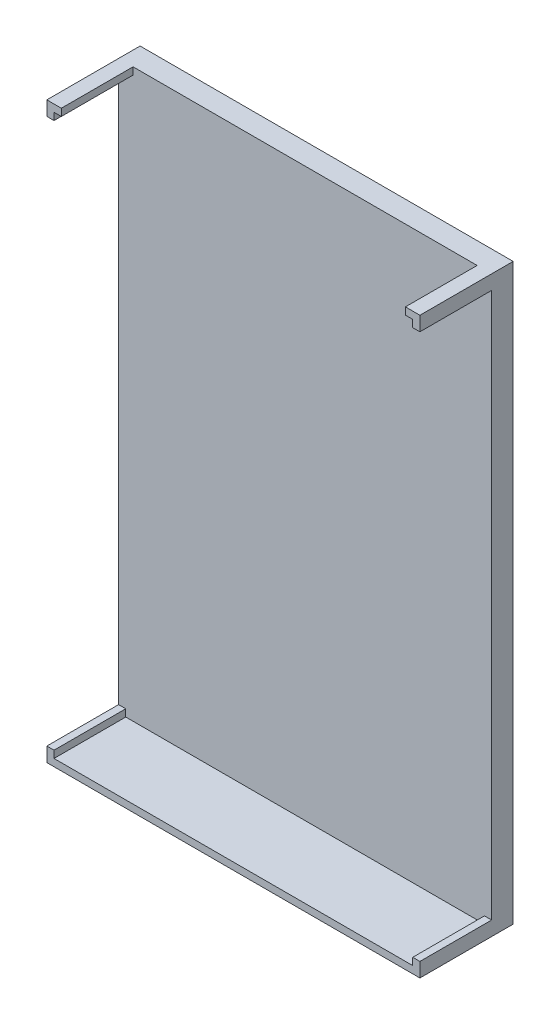
ISO-10303-21;
HEADER;
FILE_DESCRIPTION(('STEP AP214'),'2;1');
FILE_NAME('part.step','',(''),(''),'','','');
FILE_SCHEMA(('AUTOMOTIVE_DESIGN { 1 0 10303 214 1 1 1 1 }'));
ENDSEC;
DATA;
#1=APPLICATION_CONTEXT('core data for automotive mechanical design processes');
#2=APPLICATION_PROTOCOL_DEFINITION('international standard','automotive_design',2000,#1);
#3=PRODUCT_CONTEXT('',#1,'mechanical');
#4=PRODUCT('Part','Part','',(#3));
#5=PRODUCT_RELATED_PRODUCT_CATEGORY('part','',(#4));
#6=PRODUCT_DEFINITION_FORMATION('','',#4);
#7=PRODUCT_DEFINITION_CONTEXT('part definition',#1,'design');
#8=PRODUCT_DEFINITION('design','',#6,#7);
#9=PRODUCT_DEFINITION_SHAPE('','',#8);
#10=(LENGTH_UNIT() NAMED_UNIT(*) SI_UNIT(.MILLI.,.METRE.));
#11=(NAMED_UNIT(*) PLANE_ANGLE_UNIT() SI_UNIT($,.RADIAN.));
#12=(NAMED_UNIT(*) SI_UNIT($,.STERADIAN.) SOLID_ANGLE_UNIT());
#13=UNCERTAINTY_MEASURE_WITH_UNIT(LENGTH_MEASURE(1.E-05),#10,'distance_accuracy_value','');
#14=(GEOMETRIC_REPRESENTATION_CONTEXT(3) GLOBAL_UNCERTAINTY_ASSIGNED_CONTEXT((#13)) GLOBAL_UNIT_ASSIGNED_CONTEXT((#10,
#11,#12)) REPRESENTATION_CONTEXT('',''));
#15=CARTESIAN_POINT('',(0.,0.,0.));
#16=DIRECTION('',(0.,0.,1.));
#17=DIRECTION('',(1.,0.,0.));
#18=AXIS2_PLACEMENT_3D('',#15,#16,#17);
#19=CARTESIAN_POINT('',(0.,0.,0.));
#20=DIRECTION('',(0.,0.,1.));
#21=DIRECTION('',(1.,0.,0.));
#22=AXIS2_PLACEMENT_3D('',#19,#20,#21);
#23=PLANE('',#22);
#24=DIRECTION('',(1.,0.,0.));
#25=VECTOR('',#24,1.);
#26=CARTESIAN_POINT('',(0.,-39.,0.));
#27=LINE('',#26,#25);
#28=CARTESIAN_POINT('',(-25.,-39.,0.));
#29=VERTEX_POINT('',#28);
#30=CARTESIAN_POINT('',(25.,-39.,0.));
#31=VERTEX_POINT('',#30);
#32=EDGE_CURVE('E240',#29,#31,#27,.T.);
#33=ORIENTED_EDGE('',*,*,#32,.T.);
#34=DIRECTION('',(0.,-1.,0.));
#35=VECTOR('',#34,1.);
#36=CARTESIAN_POINT('',(25.,0.,0.));
#37=LINE('',#36,#35);
#38=CARTESIAN_POINT('',(25.,-38.,0.));
#39=VERTEX_POINT('',#38);
#40=EDGE_CURVE('E214',#39,#31,#37,.T.);
#41=ORIENTED_EDGE('',*,*,#40,.F.);
#42=DIRECTION('',(-1.,0.,0.));
#43=VECTOR('',#42,1.);
#44=CARTESIAN_POINT('',(0.,-38.,0.));
#45=LINE('',#44,#43);
#46=CARTESIAN_POINT('',(26.,-38.,0.));
#47=VERTEX_POINT('',#46);
#48=EDGE_CURVE('E217',#47,#39,#45,.T.);
#49=ORIENTED_EDGE('',*,*,#48,.F.);
#50=DIRECTION('',(0.,1.,0.));
#51=VECTOR('',#50,1.);
#52=CARTESIAN_POINT('',(26.,-40.,0.));
#53=LINE('',#52,#51);
#54=CARTESIAN_POINT('',(26.,38.,0.));
#55=VERTEX_POINT('',#54);
#56=EDGE_CURVE('E297',#47,#55,#53,.T.);
#57=ORIENTED_EDGE('',*,*,#56,.T.);
#58=DIRECTION('',(-1.,0.,0.));
#59=VECTOR('',#58,1.);
#60=CARTESIAN_POINT('',(0.,38.,0.));
#61=LINE('',#60,#59);
#62=CARTESIAN_POINT('',(25.,38.,0.));
#63=VERTEX_POINT('',#62);
#64=EDGE_CURVE('E242',#55,#63,#61,.T.);
#65=ORIENTED_EDGE('',*,*,#64,.T.);
#66=DIRECTION('',(0.,1.,0.));
#67=VECTOR('',#66,1.);
#68=CARTESIAN_POINT('',(25.,0.,0.));
#69=LINE('',#68,#67);
#70=CARTESIAN_POINT('',(25.,39.,0.));
#71=VERTEX_POINT('',#70);
#72=EDGE_CURVE('E258',#63,#71,#69,.T.);
#73=ORIENTED_EDGE('',*,*,#72,.T.);
#74=DIRECTION('',(-1.,0.,0.));
#75=VECTOR('',#74,1.);
#76=CARTESIAN_POINT('',(0.,39.,0.));
#77=LINE('',#76,#75);
#78=CARTESIAN_POINT('',(23.9789278514893,39.,0.));
#79=VERTEX_POINT('',#78);
#80=EDGE_CURVE('E278',#71,#79,#77,.T.);
#81=ORIENTED_EDGE('',*,*,#80,.T.);
#82=DIRECTION('',(0.,1.,0.));
#83=VECTOR('',#82,1.);
#84=CARTESIAN_POINT('',(23.9789278514893,0.,0.));
#85=LINE('',#84,#83);
#86=CARTESIAN_POINT('',(23.9789278514893,40.,0.));
#87=VERTEX_POINT('',#86);
#88=EDGE_CURVE('E275',#79,#87,#85,.T.);
#89=ORIENTED_EDGE('',*,*,#88,.T.);
#90=DIRECTION('',(-1.,0.,0.));
#91=VECTOR('',#90,1.);
#92=CARTESIAN_POINT('',(26.,40.,0.));
#93=LINE('',#92,#91);
#94=CARTESIAN_POINT('',(-23.9789278514893,40.,0.));
#95=VERTEX_POINT('',#94);
#96=EDGE_CURVE('E307',#87,#95,#93,.T.);
#97=ORIENTED_EDGE('',*,*,#96,.T.);
#98=DIRECTION('',(0.,1.,0.));
#99=VECTOR('',#98,1.);
#100=CARTESIAN_POINT('',(-23.9789278514893,39.,0.));
#101=LINE('',#100,#99);
#102=CARTESIAN_POINT('',(-23.9789278514893,39.,0.));
#103=VERTEX_POINT('',#102);
#104=EDGE_CURVE('E188',#103,#95,#101,.T.);
#105=ORIENTED_EDGE('',*,*,#104,.F.);
#106=DIRECTION('',(1.,0.,0.));
#107=VECTOR('',#106,1.);
#108=CARTESIAN_POINT('',(-25.,39.,0.));
#109=LINE('',#108,#107);
#110=CARTESIAN_POINT('',(-25.,39.,0.));
#111=VERTEX_POINT('',#110);
#112=EDGE_CURVE('E59',#111,#103,#109,.T.);
#113=ORIENTED_EDGE('',*,*,#112,.F.);
#114=DIRECTION('',(0.,1.,0.));
#115=VECTOR('',#114,1.);
#116=CARTESIAN_POINT('',(-25.,38.,0.));
#117=LINE('',#116,#115);
#118=CARTESIAN_POINT('',(-25.,38.,0.));
#119=VERTEX_POINT('',#118);
#120=EDGE_CURVE('E54',#119,#111,#117,.T.);
#121=ORIENTED_EDGE('',*,*,#120,.F.);
#122=DIRECTION('',(1.,0.,0.));
#123=VECTOR('',#122,1.);
#124=CARTESIAN_POINT('',(-26.,38.,0.));
#125=LINE('',#124,#123);
#126=CARTESIAN_POINT('',(-26.,38.,0.));
#127=VERTEX_POINT('',#126);
#128=EDGE_CURVE('E207',#127,#119,#125,.T.);
#129=ORIENTED_EDGE('',*,*,#128,.F.);
#130=DIRECTION('',(0.,1.,0.));
#131=VECTOR('',#130,1.);
#132=CARTESIAN_POINT('',(-26.,-40.,0.));
#133=LINE('',#132,#131);
#134=CARTESIAN_POINT('',(-26.,-38.,0.));
#135=VERTEX_POINT('',#134);
#136=EDGE_CURVE('E293',#135,#127,#133,.T.);
#137=ORIENTED_EDGE('',*,*,#136,.F.);
#138=DIRECTION('',(1.,0.,0.));
#139=VECTOR('',#138,1.);
#140=CARTESIAN_POINT('',(0.,-38.,0.));
#141=LINE('',#140,#139);
#142=CARTESIAN_POINT('',(-25.,-38.,0.));
#143=VERTEX_POINT('',#142);
#144=EDGE_CURVE('E233',#135,#143,#141,.T.);
#145=ORIENTED_EDGE('',*,*,#144,.T.);
#146=DIRECTION('',(0.,-1.,0.));
#147=VECTOR('',#146,1.);
#148=CARTESIAN_POINT('',(-25.,0.,0.));
#149=LINE('',#148,#147);
#150=EDGE_CURVE('E236',#143,#29,#149,.T.);
#151=ORIENTED_EDGE('',*,*,#150,.T.);
#152=EDGE_LOOP('',(#33,#41,#49,#57,#65,#73,#81,#89,#97,#105,#113,#121,#129,#137,#145,#151));
#153=FACE_BOUND('',#152,.T.);
#154=ADVANCED_FACE('F39',(#153),#23,.T.);
#155=CARTESIAN_POINT('',(-26.,-40.,-3.));
#156=DIRECTION('',(1.,0.,0.));
#157=DIRECTION('',(0.,0.,-1.));
#158=AXIS2_PLACEMENT_3D('',#155,#156,#157);
#159=PLANE('',#158);
#160=DIRECTION('',(0.,0.,1.));
#161=VECTOR('',#160,1.);
#162=CARTESIAN_POINT('',(-26.,-40.,-3.));
#163=LINE('',#162,#161);
#164=CARTESIAN_POINT('',(-26.,-40.,-3.));
#165=VERTEX_POINT('',#164);
#166=CARTESIAN_POINT('',(-26.,-40.,10.));
#167=VERTEX_POINT('',#166);
#168=EDGE_CURVE('E304',#165,#167,#163,.T.);
#169=ORIENTED_EDGE('',*,*,#168,.T.);
#170=DIRECTION('',(0.,-1.,0.));
#171=VECTOR('',#170,1.);
#172=CARTESIAN_POINT('',(-26.,0.,10.));
#173=LINE('',#172,#171);
#174=CARTESIAN_POINT('',(-26.,-38.,10.));
#175=VERTEX_POINT('',#174);
#176=EDGE_CURVE('E244',#175,#167,#173,.T.);
#177=ORIENTED_EDGE('',*,*,#176,.F.);
#178=DIRECTION('',(0.,0.,-1.));
#179=VECTOR('',#178,1.);
#180=CARTESIAN_POINT('',(-26.,-38.,10.));
#181=LINE('',#180,#179);
#182=EDGE_CURVE('E230',#175,#135,#181,.T.);
#183=ORIENTED_EDGE('',*,*,#182,.T.);
#184=ORIENTED_EDGE('',*,*,#136,.T.);
#185=DIRECTION('',(0.,0.,-1.));
#186=VECTOR('',#185,1.);
#187=CARTESIAN_POINT('',(-26.,38.,10.));
#188=LINE('',#187,#186);
#189=CARTESIAN_POINT('',(-26.,38.,10.));
#190=VERTEX_POINT('',#189);
#191=EDGE_CURVE('E365',#190,#127,#188,.T.);
#192=ORIENTED_EDGE('',*,*,#191,.F.);
#193=DIRECTION('',(0.,-1.,0.));
#194=VECTOR('',#193,1.);
#195=CARTESIAN_POINT('',(-26.,40.,10.));
#196=LINE('',#195,#194);
#197=CARTESIAN_POINT('',(-26.,40.,10.));
#198=VERTEX_POINT('',#197);
#199=EDGE_CURVE('E197',#198,#190,#196,.T.);
#200=ORIENTED_EDGE('',*,*,#199,.F.);
#201=DIRECTION('',(0.,0.,1.));
#202=VECTOR('',#201,1.);
#203=CARTESIAN_POINT('',(-26.,40.,-3.));
#204=LINE('',#203,#202);
#205=CARTESIAN_POINT('',(-26.,40.,-3.));
#206=VERTEX_POINT('',#205);
#207=EDGE_CURVE('E11',#206,#198,#204,.T.);
#208=ORIENTED_EDGE('',*,*,#207,.F.);
#209=DIRECTION('',(0.,1.,0.));
#210=VECTOR('',#209,1.);
#211=CARTESIAN_POINT('',(-26.,-40.,-3.));
#212=LINE('',#211,#210);
#213=EDGE_CURVE('E294',#165,#206,#212,.T.);
#214=ORIENTED_EDGE('',*,*,#213,.F.);
#215=EDGE_LOOP('',(#169,#177,#183,#184,#192,#200,#208,#214));
#216=FACE_BOUND('',#215,.T.);
#217=ADVANCED_FACE('F41',(#216),#159,.F.);
#218=CARTESIAN_POINT('',(26.,40.,-3.));
#219=DIRECTION('',(0.,1.,0.));
#220=DIRECTION('',(0.,0.,1.));
#221=AXIS2_PLACEMENT_3D('',#218,#219,#220);
#222=PLANE('',#221);
#223=ORIENTED_EDGE('',*,*,#96,.F.);
#224=DIRECTION('',(0.,0.,-1.));
#225=VECTOR('',#224,1.);
#226=CARTESIAN_POINT('',(23.9789278514893,40.,10.));
#227=LINE('',#226,#225);
#228=CARTESIAN_POINT('',(23.9789278514893,40.,10.));
#229=VERTEX_POINT('',#228);
#230=EDGE_CURVE('E288',#229,#87,#227,.T.);
#231=ORIENTED_EDGE('',*,*,#230,.F.);
#232=DIRECTION('',(-1.,0.,0.));
#233=VECTOR('',#232,1.);
#234=CARTESIAN_POINT('',(0.,40.,10.));
#235=LINE('',#234,#233);
#236=CARTESIAN_POINT('',(26.,40.,10.));
#237=VERTEX_POINT('',#236);
#238=EDGE_CURVE('E261',#237,#229,#235,.T.);
#239=ORIENTED_EDGE('',*,*,#238,.F.);
#240=DIRECTION('',(0.,0.,1.));
#241=VECTOR('',#240,1.);
#242=CARTESIAN_POINT('',(26.,40.,-3.));
#243=LINE('',#242,#241);
#244=CARTESIAN_POINT('',(26.,40.,-3.));
#245=VERTEX_POINT('',#244);
#246=EDGE_CURVE('E47',#245,#237,#243,.T.);
#247=ORIENTED_EDGE('',*,*,#246,.F.);
#248=DIRECTION('',(-1.,0.,0.));
#249=VECTOR('',#248,1.);
#250=CARTESIAN_POINT('',(26.,40.,-3.));
#251=LINE('',#250,#249);
#252=EDGE_CURVE('E296',#245,#206,#251,.T.);
#253=ORIENTED_EDGE('',*,*,#252,.T.);
#254=ORIENTED_EDGE('',*,*,#207,.T.);
#255=DIRECTION('',(-1.,0.,0.));
#256=VECTOR('',#255,1.);
#257=CARTESIAN_POINT('',(-23.9789278514893,40.,10.));
#258=LINE('',#257,#256);
#259=CARTESIAN_POINT('',(-23.9789278514893,40.,10.));
#260=VERTEX_POINT('',#259);
#261=EDGE_CURVE('E177',#260,#198,#258,.T.);
#262=ORIENTED_EDGE('',*,*,#261,.F.);
#263=DIRECTION('',(0.,0.,-1.));
#264=VECTOR('',#263,1.);
#265=CARTESIAN_POINT('',(-23.9789278514893,40.,10.));
#266=LINE('',#265,#264);
#267=EDGE_CURVE('E183',#260,#95,#266,.T.);
#268=ORIENTED_EDGE('',*,*,#267,.T.);
#269=EDGE_LOOP('',(#223,#231,#239,#247,#253,#254,#262,#268));
#270=FACE_BOUND('',#269,.T.);
#271=ADVANCED_FACE('F193',(#270),#222,.T.);
#272=CARTESIAN_POINT('',(26.,-40.,-3.));
#273=DIRECTION('',(1.,0.,0.));
#274=DIRECTION('',(0.,0.,-1.));
#275=AXIS2_PLACEMENT_3D('',#272,#273,#274);
#276=PLANE('',#275);
#277=ORIENTED_EDGE('',*,*,#56,.F.);
#278=DIRECTION('',(0.,0.,-1.));
#279=VECTOR('',#278,1.);
#280=CARTESIAN_POINT('',(26.,-38.,10.));
#281=LINE('',#280,#279);
#282=CARTESIAN_POINT('',(26.,-38.,10.));
#283=VERTEX_POINT('',#282);
#284=EDGE_CURVE('E204',#283,#47,#281,.T.);
#285=ORIENTED_EDGE('',*,*,#284,.F.);
#286=DIRECTION('',(0.,1.,0.));
#287=VECTOR('',#286,1.);
#288=CARTESIAN_POINT('',(26.,0.,10.));
#289=LINE('',#288,#287);
#290=CARTESIAN_POINT('',(26.,-40.,10.));
#291=VERTEX_POINT('',#290);
#292=EDGE_CURVE('E218',#291,#283,#289,.T.);
#293=ORIENTED_EDGE('',*,*,#292,.F.);
#294=DIRECTION('',(0.,0.,1.));
#295=VECTOR('',#294,1.);
#296=CARTESIAN_POINT('',(26.,-40.,-3.));
#297=LINE('',#296,#295);
#298=CARTESIAN_POINT('',(26.,-40.,-3.));
#299=VERTEX_POINT('',#298);
#300=EDGE_CURVE('E311',#299,#291,#297,.T.);
#301=ORIENTED_EDGE('',*,*,#300,.F.);
#302=DIRECTION('',(0.,1.,0.));
#303=VECTOR('',#302,1.);
#304=CARTESIAN_POINT('',(26.,-40.,-3.));
#305=LINE('',#304,#303);
#306=EDGE_CURVE('E299',#299,#245,#305,.T.);
#307=ORIENTED_EDGE('',*,*,#306,.T.);
#308=ORIENTED_EDGE('',*,*,#246,.T.);
#309=DIRECTION('',(0.,1.,0.));
#310=VECTOR('',#309,1.);
#311=CARTESIAN_POINT('',(26.,0.,10.));
#312=LINE('',#311,#310);
#313=CARTESIAN_POINT('',(26.,38.,10.));
#314=VERTEX_POINT('',#313);
#315=EDGE_CURVE('E257',#314,#237,#312,.T.);
#316=ORIENTED_EDGE('',*,*,#315,.F.);
#317=DIRECTION('',(0.,0.,-1.));
#318=VECTOR('',#317,1.);
#319=CARTESIAN_POINT('',(26.,38.,10.));
#320=LINE('',#319,#318);
#321=EDGE_CURVE('E290',#314,#55,#320,.T.);
#322=ORIENTED_EDGE('',*,*,#321,.T.);
#323=EDGE_LOOP('',(#277,#285,#293,#301,#307,#308,#316,#322));
#324=FACE_BOUND('',#323,.T.);
#325=ADVANCED_FACE('F316',(#324),#276,.T.);
#326=CARTESIAN_POINT('',(26.,-40.,-3.));
#327=DIRECTION('',(0.,1.,0.));
#328=DIRECTION('',(-1.,0.,0.));
#329=AXIS2_PLACEMENT_3D('',#326,#327,#328);
#330=PLANE('',#329);
#331=ORIENTED_EDGE('',*,*,#300,.T.);
#332=DIRECTION('',(1.,0.,0.));
#333=VECTOR('',#332,1.);
#334=CARTESIAN_POINT('',(0.,-40.,10.));
#335=LINE('',#334,#333);
#336=EDGE_CURVE('E232',#167,#291,#335,.T.);
#337=ORIENTED_EDGE('',*,*,#336,.F.);
#338=ORIENTED_EDGE('',*,*,#168,.F.);
#339=DIRECTION('',(-1.,0.,0.));
#340=VECTOR('',#339,1.);
#341=CARTESIAN_POINT('',(26.,-40.,-3.));
#342=LINE('',#341,#340);
#343=EDGE_CURVE('E302',#299,#165,#342,.T.);
#344=ORIENTED_EDGE('',*,*,#343,.F.);
#345=EDGE_LOOP('',(#331,#337,#338,#344));
#346=FACE_BOUND('',#345,.T.);
#347=ADVANCED_FACE('F358',(#346),#330,.F.);
#348=CARTESIAN_POINT('',(0.,0.,-3.));
#349=DIRECTION('',(0.,0.,1.));
#350=DIRECTION('',(1.,0.,0.));
#351=AXIS2_PLACEMENT_3D('',#348,#349,#350);
#352=PLANE('',#351);
#353=ORIENTED_EDGE('',*,*,#213,.T.);
#354=ORIENTED_EDGE('',*,*,#252,.F.);
#355=ORIENTED_EDGE('',*,*,#306,.F.);
#356=ORIENTED_EDGE('',*,*,#343,.T.);
#357=EDGE_LOOP('',(#353,#354,#355,#356));
#358=FACE_BOUND('',#357,.T.);
#359=ADVANCED_FACE('F361',(#358),#352,.F.);
#360=CARTESIAN_POINT('',(0.,38.,10.));
#361=DIRECTION('',(0.,-1.,0.));
#362=DIRECTION('',(0.,0.,-1.));
#363=AXIS2_PLACEMENT_3D('',#360,#361,#362);
#364=PLANE('',#363);
#365=ORIENTED_EDGE('',*,*,#64,.F.);
#366=ORIENTED_EDGE('',*,*,#321,.F.);
#367=DIRECTION('',(-1.,0.,0.));
#368=VECTOR('',#367,1.);
#369=CARTESIAN_POINT('',(0.,38.,10.));
#370=LINE('',#369,#368);
#371=CARTESIAN_POINT('',(25.,38.,10.));
#372=VERTEX_POINT('',#371);
#373=EDGE_CURVE('E254',#314,#372,#370,.T.);
#374=ORIENTED_EDGE('',*,*,#373,.T.);
#375=DIRECTION('',(0.,0.,-1.));
#376=VECTOR('',#375,1.);
#377=CARTESIAN_POINT('',(25.,38.,10.));
#378=LINE('',#377,#376);
#379=EDGE_CURVE('E272',#372,#63,#378,.T.);
#380=ORIENTED_EDGE('',*,*,#379,.T.);
#381=EDGE_LOOP('',(#365,#366,#374,#380));
#382=FACE_BOUND('',#381,.T.);
#383=ADVANCED_FACE('F338',(#382),#364,.T.);
#384=CARTESIAN_POINT('',(23.9789278514893,0.,10.));
#385=DIRECTION('',(-1.,0.,0.));
#386=DIRECTION('',(0.,0.,1.));
#387=AXIS2_PLACEMENT_3D('',#384,#385,#386);
#388=PLANE('',#387);
#389=ORIENTED_EDGE('',*,*,#88,.F.);
#390=DIRECTION('',(0.,0.,-1.));
#391=VECTOR('',#390,1.);
#392=CARTESIAN_POINT('',(23.9789278514893,39.,10.));
#393=LINE('',#392,#391);
#394=CARTESIAN_POINT('',(23.9789278514893,39.,10.));
#395=VERTEX_POINT('',#394);
#396=EDGE_CURVE('E286',#395,#79,#393,.T.);
#397=ORIENTED_EDGE('',*,*,#396,.F.);
#398=DIRECTION('',(0.,1.,0.));
#399=VECTOR('',#398,1.);
#400=CARTESIAN_POINT('',(23.9789278514893,0.,10.));
#401=LINE('',#400,#399);
#402=EDGE_CURVE('E263',#395,#229,#401,.T.);
#403=ORIENTED_EDGE('',*,*,#402,.T.);
#404=ORIENTED_EDGE('',*,*,#230,.T.);
#405=EDGE_LOOP('',(#389,#397,#403,#404));
#406=FACE_BOUND('',#405,.T.);
#407=ADVANCED_FACE('F328',(#406),#388,.T.);
#408=CARTESIAN_POINT('',(0.,39.,10.));
#409=DIRECTION('',(0.,-1.,0.));
#410=DIRECTION('',(0.,0.,-1.));
#411=AXIS2_PLACEMENT_3D('',#408,#409,#410);
#412=PLANE('',#411);
#413=ORIENTED_EDGE('',*,*,#80,.F.);
#414=DIRECTION('',(0.,0.,-1.));
#415=VECTOR('',#414,1.);
#416=CARTESIAN_POINT('',(25.,39.,10.));
#417=LINE('',#416,#415);
#418=CARTESIAN_POINT('',(25.,39.,10.));
#419=VERTEX_POINT('',#418);
#420=EDGE_CURVE('E284',#419,#71,#417,.T.);
#421=ORIENTED_EDGE('',*,*,#420,.F.);
#422=DIRECTION('',(-1.,0.,0.));
#423=VECTOR('',#422,1.);
#424=CARTESIAN_POINT('',(0.,39.,10.));
#425=LINE('',#424,#423);
#426=EDGE_CURVE('E266',#419,#395,#425,.T.);
#427=ORIENTED_EDGE('',*,*,#426,.T.);
#428=ORIENTED_EDGE('',*,*,#396,.T.);
#429=EDGE_LOOP('',(#413,#421,#427,#428));
#430=FACE_BOUND('',#429,.T.);
#431=ADVANCED_FACE('F332',(#430),#412,.T.);
#432=CARTESIAN_POINT('',(25.,0.,10.));
#433=DIRECTION('',(-1.,0.,0.));
#434=DIRECTION('',(0.,0.,1.));
#435=AXIS2_PLACEMENT_3D('',#432,#433,#434);
#436=PLANE('',#435);
#437=ORIENTED_EDGE('',*,*,#72,.F.);
#438=ORIENTED_EDGE('',*,*,#379,.F.);
#439=DIRECTION('',(0.,1.,0.));
#440=VECTOR('',#439,1.);
#441=CARTESIAN_POINT('',(25.,0.,10.));
#442=LINE('',#441,#440);
#443=EDGE_CURVE('E269',#372,#419,#442,.T.);
#444=ORIENTED_EDGE('',*,*,#443,.T.);
#445=ORIENTED_EDGE('',*,*,#420,.T.);
#446=EDGE_LOOP('',(#437,#438,#444,#445));
#447=FACE_BOUND('',#446,.T.);
#448=ADVANCED_FACE('F335',(#447),#436,.T.);
#449=CARTESIAN_POINT('',(0.,0.,10.));
#450=DIRECTION('',(0.,0.,1.));
#451=DIRECTION('',(1.,0.,0.));
#452=AXIS2_PLACEMENT_3D('',#449,#450,#451);
#453=PLANE('',#452);
#454=ORIENTED_EDGE('',*,*,#373,.F.);
#455=ORIENTED_EDGE('',*,*,#315,.T.);
#456=ORIENTED_EDGE('',*,*,#238,.T.);
#457=ORIENTED_EDGE('',*,*,#402,.F.);
#458=ORIENTED_EDGE('',*,*,#426,.F.);
#459=ORIENTED_EDGE('',*,*,#443,.F.);
#460=EDGE_LOOP('',(#454,#455,#456,#457,#458,#459));
#461=FACE_BOUND('',#460,.T.);
#462=ADVANCED_FACE('F322',(#461),#453,.T.);
#463=CARTESIAN_POINT('',(0.,-39.,10.));
#464=DIRECTION('',(0.,1.,0.));
#465=DIRECTION('',(0.,0.,1.));
#466=AXIS2_PLACEMENT_3D('',#463,#464,#465);
#467=PLANE('',#466);
#468=ORIENTED_EDGE('',*,*,#32,.F.);
#469=DIRECTION('',(0.,0.,-1.));
#470=VECTOR('',#469,1.);
#471=CARTESIAN_POINT('',(-25.,-39.,10.));
#472=LINE('',#471,#470);
#473=CARTESIAN_POINT('',(-25.,-39.,10.));
#474=VERTEX_POINT('',#473);
#475=EDGE_CURVE('E220',#474,#29,#472,.T.);
#476=ORIENTED_EDGE('',*,*,#475,.F.);
#477=DIRECTION('',(1.,0.,0.));
#478=VECTOR('',#477,1.);
#479=CARTESIAN_POINT('',(0.,-39.,10.));
#480=LINE('',#479,#478);
#481=CARTESIAN_POINT('',(25.,-39.,10.));
#482=VERTEX_POINT('',#481);
#483=EDGE_CURVE('E237',#474,#482,#480,.T.);
#484=ORIENTED_EDGE('',*,*,#483,.T.);
#485=DIRECTION('',(0.,0.,-1.));
#486=VECTOR('',#485,1.);
#487=CARTESIAN_POINT('',(25.,-39.,10.));
#488=LINE('',#487,#486);
#489=EDGE_CURVE('E210',#482,#31,#488,.T.);
#490=ORIENTED_EDGE('',*,*,#489,.T.);
#491=EDGE_LOOP('',(#468,#476,#484,#490));
#492=FACE_BOUND('',#491,.T.);
#493=ADVANCED_FACE('F454',(#492),#467,.T.);
#494=CARTESIAN_POINT('',(-25.,0.,10.));
#495=DIRECTION('',(1.,0.,0.));
#496=DIRECTION('',(0.,0.,-1.));
#497=AXIS2_PLACEMENT_3D('',#494,#495,#496);
#498=PLANE('',#497);
#499=ORIENTED_EDGE('',*,*,#150,.F.);
#500=DIRECTION('',(0.,0.,-1.));
#501=VECTOR('',#500,1.);
#502=CARTESIAN_POINT('',(-25.,-38.,10.));
#503=LINE('',#502,#501);
#504=CARTESIAN_POINT('',(-25.,-38.,10.));
#505=VERTEX_POINT('',#504);
#506=EDGE_CURVE('E228',#505,#143,#503,.T.);
#507=ORIENTED_EDGE('',*,*,#506,.F.);
#508=DIRECTION('',(0.,-1.,0.));
#509=VECTOR('',#508,1.);
#510=CARTESIAN_POINT('',(-25.,0.,10.));
#511=LINE('',#510,#509);
#512=EDGE_CURVE('E250',#505,#474,#511,.T.);
#513=ORIENTED_EDGE('',*,*,#512,.T.);
#514=ORIENTED_EDGE('',*,*,#475,.T.);
#515=EDGE_LOOP('',(#499,#507,#513,#514));
#516=FACE_BOUND('',#515,.T.);
#517=ADVANCED_FACE('F459',(#516),#498,.T.);
#518=CARTESIAN_POINT('',(0.,-38.,10.));
#519=DIRECTION('',(0.,1.,0.));
#520=DIRECTION('',(0.,0.,1.));
#521=AXIS2_PLACEMENT_3D('',#518,#519,#520);
#522=PLANE('',#521);
#523=ORIENTED_EDGE('',*,*,#144,.F.);
#524=ORIENTED_EDGE('',*,*,#182,.F.);
#525=DIRECTION('',(1.,0.,0.));
#526=VECTOR('',#525,1.);
#527=CARTESIAN_POINT('',(0.,-38.,10.));
#528=LINE('',#527,#526);
#529=EDGE_CURVE('E247',#175,#505,#528,.T.);
#530=ORIENTED_EDGE('',*,*,#529,.T.);
#531=ORIENTED_EDGE('',*,*,#506,.T.);
#532=EDGE_LOOP('',(#523,#524,#530,#531));
#533=FACE_BOUND('',#532,.T.);
#534=ADVANCED_FACE('F462',(#533),#522,.T.);
#535=CARTESIAN_POINT('',(0.,0.,10.));
#536=DIRECTION('',(0.,0.,1.));
#537=DIRECTION('',(1.,0.,0.));
#538=AXIS2_PLACEMENT_3D('',#535,#536,#537);
#539=PLANE('',#538);
#540=ORIENTED_EDGE('',*,*,#336,.T.);
#541=ORIENTED_EDGE('',*,*,#292,.T.);
#542=DIRECTION('',(-1.,0.,0.));
#543=VECTOR('',#542,1.);
#544=CARTESIAN_POINT('',(0.,-38.,10.));
#545=LINE('',#544,#543);
#546=CARTESIAN_POINT('',(25.,-38.,10.));
#547=VERTEX_POINT('',#546);
#548=EDGE_CURVE('E223',#283,#547,#545,.T.);
#549=ORIENTED_EDGE('',*,*,#548,.T.);
#550=DIRECTION('',(0.,-1.,0.));
#551=VECTOR('',#550,1.);
#552=CARTESIAN_POINT('',(25.,0.,10.));
#553=LINE('',#552,#551);
#554=EDGE_CURVE('E213',#547,#482,#553,.T.);
#555=ORIENTED_EDGE('',*,*,#554,.T.);
#556=ORIENTED_EDGE('',*,*,#483,.F.);
#557=ORIENTED_EDGE('',*,*,#512,.F.);
#558=ORIENTED_EDGE('',*,*,#529,.F.);
#559=ORIENTED_EDGE('',*,*,#176,.T.);
#560=EDGE_LOOP('',(#540,#541,#549,#555,#556,#557,#558,#559));
#561=FACE_BOUND('',#560,.T.);
#562=ADVANCED_FACE('F352',(#561),#539,.T.);
#563=CARTESIAN_POINT('',(0.,-38.,10.));
#564=DIRECTION('',(0.,-1.,0.));
#565=DIRECTION('',(0.,0.,-1.));
#566=AXIS2_PLACEMENT_3D('',#563,#564,#565);
#567=PLANE('',#566);
#568=ORIENTED_EDGE('',*,*,#48,.T.);
#569=DIRECTION('',(0.,0.,-1.));
#570=VECTOR('',#569,1.);
#571=CARTESIAN_POINT('',(25.,-38.,10.));
#572=LINE('',#571,#570);
#573=EDGE_CURVE('E206',#547,#39,#572,.T.);
#574=ORIENTED_EDGE('',*,*,#573,.F.);
#575=ORIENTED_EDGE('',*,*,#548,.F.);
#576=ORIENTED_EDGE('',*,*,#284,.T.);
#577=EDGE_LOOP('',(#568,#574,#575,#576));
#578=FACE_BOUND('',#577,.T.);
#579=ADVANCED_FACE('F345',(#578),#567,.F.);
#580=CARTESIAN_POINT('',(25.,0.,10.));
#581=DIRECTION('',(1.,0.,0.));
#582=DIRECTION('',(0.,0.,-1.));
#583=AXIS2_PLACEMENT_3D('',#580,#581,#582);
#584=PLANE('',#583);
#585=ORIENTED_EDGE('',*,*,#40,.T.);
#586=ORIENTED_EDGE('',*,*,#489,.F.);
#587=ORIENTED_EDGE('',*,*,#554,.F.);
#588=ORIENTED_EDGE('',*,*,#573,.T.);
#589=EDGE_LOOP('',(#585,#586,#587,#588));
#590=FACE_BOUND('',#589,.T.);
#591=ADVANCED_FACE('F348',(#590),#584,.F.);
#592=CARTESIAN_POINT('',(-26.,38.,10.));
#593=DIRECTION('',(0.,1.,0.));
#594=DIRECTION('',(0.,0.,1.));
#595=AXIS2_PLACEMENT_3D('',#592,#593,#594);
#596=PLANE('',#595);
#597=ORIENTED_EDGE('',*,*,#128,.T.);
#598=DIRECTION('',(0.,0.,-1.));
#599=VECTOR('',#598,1.);
#600=CARTESIAN_POINT('',(-25.,38.,10.));
#601=LINE('',#600,#599);
#602=CARTESIAN_POINT('',(-25.,38.,10.));
#603=VERTEX_POINT('',#602);
#604=EDGE_CURVE('E373',#603,#119,#601,.T.);
#605=ORIENTED_EDGE('',*,*,#604,.F.);
#606=DIRECTION('',(1.,0.,0.));
#607=VECTOR('',#606,1.);
#608=CARTESIAN_POINT('',(-26.,38.,10.));
#609=LINE('',#608,#607);
#610=EDGE_CURVE('E200',#190,#603,#609,.T.);
#611=ORIENTED_EDGE('',*,*,#610,.F.);
#612=ORIENTED_EDGE('',*,*,#191,.T.);
#613=EDGE_LOOP('',(#597,#605,#611,#612));
#614=FACE_BOUND('',#613,.T.);
#615=ADVANCED_FACE('F374',(#614),#596,.F.);
#616=CARTESIAN_POINT('',(-25.,38.,10.));
#617=DIRECTION('',(-1.,0.,0.));
#618=DIRECTION('',(0.,0.,1.));
#619=AXIS2_PLACEMENT_3D('',#616,#617,#618);
#620=PLANE('',#619);
#621=ORIENTED_EDGE('',*,*,#120,.T.);
#622=DIRECTION('',(0.,0.,-1.));
#623=VECTOR('',#622,1.);
#624=CARTESIAN_POINT('',(-25.,39.,10.));
#625=LINE('',#624,#623);
#626=CARTESIAN_POINT('',(-25.,39.,10.));
#627=VERTEX_POINT('',#626);
#628=EDGE_CURVE('E376',#627,#111,#625,.T.);
#629=ORIENTED_EDGE('',*,*,#628,.F.);
#630=DIRECTION('',(0.,1.,0.));
#631=VECTOR('',#630,1.);
#632=CARTESIAN_POINT('',(-25.,38.,10.));
#633=LINE('',#632,#631);
#634=EDGE_CURVE('E369',#603,#627,#633,.T.);
#635=ORIENTED_EDGE('',*,*,#634,.F.);
#636=ORIENTED_EDGE('',*,*,#604,.T.);
#637=EDGE_LOOP('',(#621,#629,#635,#636));
#638=FACE_BOUND('',#637,.T.);
#639=ADVANCED_FACE('F378',(#638),#620,.F.);
#640=CARTESIAN_POINT('',(-25.,39.,10.));
#641=DIRECTION('',(0.,1.,0.));
#642=DIRECTION('',(0.,0.,1.));
#643=AXIS2_PLACEMENT_3D('',#640,#641,#642);
#644=PLANE('',#643);
#645=ORIENTED_EDGE('',*,*,#112,.T.);
#646=DIRECTION('',(0.,0.,-1.));
#647=VECTOR('',#646,1.);
#648=CARTESIAN_POINT('',(-23.9789278514893,39.,10.));
#649=LINE('',#648,#647);
#650=CARTESIAN_POINT('',(-23.9789278514893,39.,10.));
#651=VERTEX_POINT('',#650);
#652=EDGE_CURVE('E191',#651,#103,#649,.T.);
#653=ORIENTED_EDGE('',*,*,#652,.F.);
#654=DIRECTION('',(1.,0.,0.));
#655=VECTOR('',#654,1.);
#656=CARTESIAN_POINT('',(-25.,39.,10.));
#657=LINE('',#656,#655);
#658=EDGE_CURVE('E179',#627,#651,#657,.T.);
#659=ORIENTED_EDGE('',*,*,#658,.F.);
#660=ORIENTED_EDGE('',*,*,#628,.T.);
#661=EDGE_LOOP('',(#645,#653,#659,#660));
#662=FACE_BOUND('',#661,.T.);
#663=ADVANCED_FACE('F389',(#662),#644,.F.);
#664=CARTESIAN_POINT('',(-23.9789278514893,39.,10.));
#665=DIRECTION('',(-1.,0.,0.));
#666=DIRECTION('',(0.,0.,1.));
#667=AXIS2_PLACEMENT_3D('',#664,#665,#666);
#668=PLANE('',#667);
#669=ORIENTED_EDGE('',*,*,#104,.T.);
#670=ORIENTED_EDGE('',*,*,#267,.F.);
#671=DIRECTION('',(0.,1.,0.));
#672=VECTOR('',#671,1.);
#673=CARTESIAN_POINT('',(-23.9789278514893,39.,10.));
#674=LINE('',#673,#672);
#675=EDGE_CURVE('E173',#651,#260,#674,.T.);
#676=ORIENTED_EDGE('',*,*,#675,.F.);
#677=ORIENTED_EDGE('',*,*,#652,.T.);
#678=EDGE_LOOP('',(#669,#670,#676,#677));
#679=FACE_BOUND('',#678,.T.);
#680=ADVANCED_FACE('F187',(#679),#668,.F.);
#681=CARTESIAN_POINT('',(0.,0.,10.));
#682=DIRECTION('',(0.,0.,1.));
#683=DIRECTION('',(1.,0.,0.));
#684=AXIS2_PLACEMENT_3D('',#681,#682,#683);
#685=PLANE('',#684);
#686=ORIENTED_EDGE('',*,*,#261,.T.);
#687=ORIENTED_EDGE('',*,*,#199,.T.);
#688=ORIENTED_EDGE('',*,*,#610,.T.);
#689=ORIENTED_EDGE('',*,*,#634,.T.);
#690=ORIENTED_EDGE('',*,*,#658,.T.);
#691=ORIENTED_EDGE('',*,*,#675,.T.);
#692=EDGE_LOOP('',(#686,#687,#688,#689,#690,#691));
#693=FACE_BOUND('',#692,.T.);
#694=ADVANCED_FACE('F175',(#693),#685,.T.);
#695=CLOSED_SHELL('',(#154,#217,#271,#325,#347,#359,#383,#407,#431,#448,#462,#493,#517,#534,
#562,#579,#591,#615,#639,#663,#680,#694));
#696=MANIFOLD_SOLID_BREP('B2',#695);
#697=ADVANCED_BREP_SHAPE_REPRESENTATION('',(#18,#696),#14);
#698=SHAPE_DEFINITION_REPRESENTATION(#9,#697);
ENDSEC;
END-ISO-10303-21;
